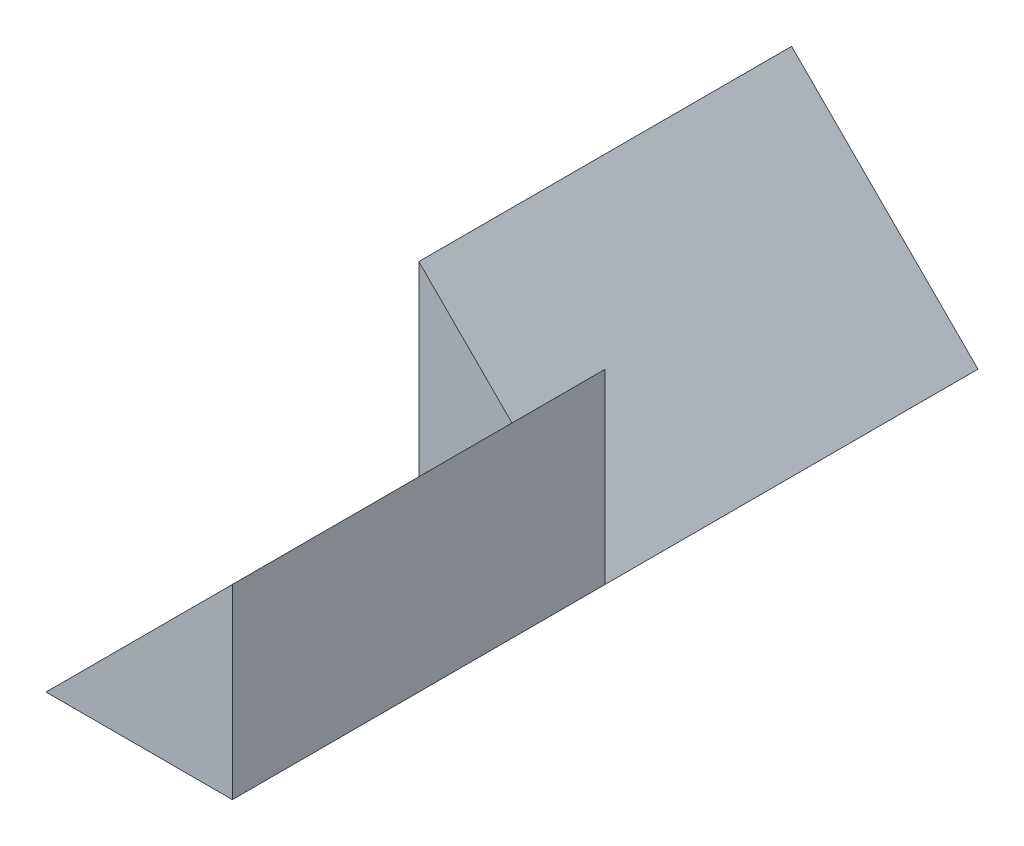
ISO-10303-21;
HEADER;
FILE_DESCRIPTION(('STEP AP214'),'2;1');
FILE_NAME('part.step','',(''),(''),'','','');
FILE_SCHEMA(('AUTOMOTIVE_DESIGN { 1 0 10303 214 1 1 1 1 }'));
ENDSEC;
DATA;
#1=APPLICATION_CONTEXT('core data for automotive mechanical design processes');
#2=APPLICATION_PROTOCOL_DEFINITION('international standard','automotive_design',2000,#1);
#3=PRODUCT_CONTEXT('',#1,'mechanical');
#4=PRODUCT('Part','Part','',(#3));
#5=PRODUCT_RELATED_PRODUCT_CATEGORY('part','',(#4));
#6=PRODUCT_DEFINITION_FORMATION('','',#4);
#7=PRODUCT_DEFINITION_CONTEXT('part definition',#1,'design');
#8=PRODUCT_DEFINITION('design','',#6,#7);
#9=PRODUCT_DEFINITION_SHAPE('','',#8);
#10=(LENGTH_UNIT() NAMED_UNIT(*) SI_UNIT(.MILLI.,.METRE.));
#11=(NAMED_UNIT(*) PLANE_ANGLE_UNIT() SI_UNIT($,.RADIAN.));
#12=(NAMED_UNIT(*) SI_UNIT($,.STERADIAN.) SOLID_ANGLE_UNIT());
#13=UNCERTAINTY_MEASURE_WITH_UNIT(LENGTH_MEASURE(1.E-05),#10,'distance_accuracy_value','');
#14=(GEOMETRIC_REPRESENTATION_CONTEXT(3) GLOBAL_UNCERTAINTY_ASSIGNED_CONTEXT((#13)) GLOBAL_UNIT_ASSIGNED_CONTEXT((#10,
#11,#12)) REPRESENTATION_CONTEXT('',''));
#15=CARTESIAN_POINT('',(0.,0.,0.));
#16=DIRECTION('',(0.,0.,1.));
#17=DIRECTION('',(1.,0.,0.));
#18=AXIS2_PLACEMENT_3D('',#15,#16,#17);
#19=CARTESIAN_POINT('',(0.,0.,2.));
#20=DIRECTION('',(0.,0.,-1.));
#21=DIRECTION('',(-1.,0.,0.));
#22=AXIS2_PLACEMENT_3D('',#19,#20,#21);
#23=PLANE('',#22);
#24=DIRECTION('',(-0.707106781186544,-0.707106781186551,0.));
#25=VECTOR('',#24,1.);
#26=CARTESIAN_POINT('',(1.,1.00000000000001,2.));
#27=LINE('',#26,#25);
#28=CARTESIAN_POINT('',(0.499999999999999,0.500000000000004,2.));
#29=VERTEX_POINT('',#28);
#30=CARTESIAN_POINT('',(0.,0.,2.));
#31=VERTEX_POINT('',#30);
#32=EDGE_CURVE('E11',#29,#31,#27,.T.);
#33=ORIENTED_EDGE('',*,*,#32,.F.);
#34=DIRECTION('',(-0.707106781186542,0.707106781186553,0.));
#35=VECTOR('',#34,1.);
#36=CARTESIAN_POINT('',(0.,1.00000000000001,2.));
#37=LINE('',#36,#35);
#38=CARTESIAN_POINT('',(0.,1.00000000000001,2.));
#39=VERTEX_POINT('',#38);
#40=EDGE_CURVE('E52',#29,#39,#37,.T.);
#41=ORIENTED_EDGE('',*,*,#40,.T.);
#42=DIRECTION('',(0.,-1.,0.));
#43=VECTOR('',#42,1.);
#44=CARTESIAN_POINT('',(0.,0.,2.));
#45=LINE('',#44,#43);
#46=EDGE_CURVE('E89',#39,#31,#45,.T.);
#47=ORIENTED_EDGE('',*,*,#46,.T.);
#48=EDGE_LOOP('',(#33,#41,#47));
#49=FACE_BOUND('',#48,.T.);
#50=ADVANCED_FACE('F33',(#49),#23,.F.);
#51=CARTESIAN_POINT('',(1.,0.,2.));
#52=DIRECTION('',(0.,1.,0.));
#53=DIRECTION('',(-1.,0.,0.));
#54=AXIS2_PLACEMENT_3D('',#51,#52,#53);
#55=PLANE('',#54);
#56=DIRECTION('',(1.,0.,0.));
#57=VECTOR('',#56,1.);
#58=CARTESIAN_POINT('',(1.,0.,0.));
#59=LINE('',#58,#57);
#60=CARTESIAN_POINT('',(0.,0.,0.));
#61=VERTEX_POINT('',#60);
#62=CARTESIAN_POINT('',(1.,0.,0.));
#63=VERTEX_POINT('',#62);
#64=EDGE_CURVE('E85',#61,#63,#59,.T.);
#65=ORIENTED_EDGE('',*,*,#64,.T.);
#66=DIRECTION('',(0.,0.,-1.));
#67=VECTOR('',#66,1.);
#68=CARTESIAN_POINT('',(1.,0.,2.));
#69=LINE('',#68,#67);
#70=CARTESIAN_POINT('',(1.,0.,2.));
#71=VERTEX_POINT('',#70);
#72=EDGE_CURVE('E37',#71,#63,#69,.T.);
#73=ORIENTED_EDGE('',*,*,#72,.F.);
#74=DIRECTION('',(0.,0.,-1.));
#75=VECTOR('',#74,1.);
#76=CARTESIAN_POINT('',(1.,0.,4.));
#77=LINE('',#76,#75);
#78=CARTESIAN_POINT('',(1.,0.,4.));
#79=VERTEX_POINT('',#78);
#80=EDGE_CURVE('E93',#79,#71,#77,.T.);
#81=ORIENTED_EDGE('',*,*,#80,.F.);
#82=DIRECTION('',(1.,0.,0.));
#83=VECTOR('',#82,1.);
#84=CARTESIAN_POINT('',(0.,0.,4.));
#85=LINE('',#84,#83);
#86=CARTESIAN_POINT('',(0.,0.,4.));
#87=VERTEX_POINT('',#86);
#88=EDGE_CURVE('E130',#87,#79,#85,.T.);
#89=ORIENTED_EDGE('',*,*,#88,.F.);
#90=DIRECTION('',(0.,0.,-1.));
#91=VECTOR('',#90,1.);
#92=CARTESIAN_POINT('',(0.,0.,4.));
#93=LINE('',#92,#91);
#94=EDGE_CURVE('E88',#87,#31,#93,.T.);
#95=ORIENTED_EDGE('',*,*,#94,.T.);
#96=DIRECTION('',(0.,0.,-1.));
#97=VECTOR('',#96,1.);
#98=CARTESIAN_POINT('',(0.,0.,2.));
#99=LINE('',#98,#97);
#100=EDGE_CURVE('E75',#31,#61,#99,.T.);
#101=ORIENTED_EDGE('',*,*,#100,.T.);
#102=EDGE_LOOP('',(#65,#73,#81,#89,#95,#101));
#103=FACE_BOUND('',#102,.T.);
#104=ADVANCED_FACE('F35',(#103),#55,.F.);
#105=CARTESIAN_POINT('',(0.,1.00000000000001,2.));
#106=DIRECTION('',(-0.707106781186553,-0.707106781186542,0.));
#107=DIRECTION('',(0.707106781186542,-0.707106781186553,0.));
#108=AXIS2_PLACEMENT_3D('',#105,#106,#107);
#109=PLANE('',#108);
#110=DIRECTION('',(-0.707106781186542,0.707106781186553,0.));
#111=VECTOR('',#110,1.);
#112=CARTESIAN_POINT('',(0.,1.00000000000001,0.));
#113=LINE('',#112,#111);
#114=CARTESIAN_POINT('',(0.,1.00000000000001,0.));
#115=VERTEX_POINT('',#114);
#116=EDGE_CURVE('E79',#63,#115,#113,.T.);
#117=ORIENTED_EDGE('',*,*,#116,.T.);
#118=DIRECTION('',(0.,0.,-1.));
#119=VECTOR('',#118,1.);
#120=CARTESIAN_POINT('',(0.,1.00000000000001,2.));
#121=LINE('',#120,#119);
#122=EDGE_CURVE('E76',#39,#115,#121,.T.);
#123=ORIENTED_EDGE('',*,*,#122,.F.);
#124=ORIENTED_EDGE('',*,*,#40,.F.);
#125=EDGE_CURVE('E104',#71,#29,#37,.T.);
#126=ORIENTED_EDGE('',*,*,#125,.F.);
#127=ORIENTED_EDGE('',*,*,#72,.T.);
#128=EDGE_LOOP('',(#117,#123,#124,#126,#127));
#129=FACE_BOUND('',#128,.T.);
#130=ADVANCED_FACE('F102',(#129),#109,.F.);
#131=CARTESIAN_POINT('',(0.,0.,2.));
#132=DIRECTION('',(1.,0.,0.));
#133=DIRECTION('',(0.,0.,-1.));
#134=AXIS2_PLACEMENT_3D('',#131,#132,#133);
#135=PLANE('',#134);
#136=DIRECTION('',(0.,-1.,0.));
#137=VECTOR('',#136,1.);
#138=CARTESIAN_POINT('',(0.,0.,0.));
#139=LINE('',#138,#137);
#140=EDGE_CURVE('E70',#115,#61,#139,.T.);
#141=ORIENTED_EDGE('',*,*,#140,.T.);
#142=ORIENTED_EDGE('',*,*,#100,.F.);
#143=ORIENTED_EDGE('',*,*,#46,.F.);
#144=ORIENTED_EDGE('',*,*,#122,.T.);
#145=EDGE_LOOP('',(#141,#142,#143,#144));
#146=FACE_BOUND('',#145,.T.);
#147=ADVANCED_FACE('F72',(#146),#135,.F.);
#148=CARTESIAN_POINT('',(0.,0.,0.));
#149=DIRECTION('',(0.,0.,-1.));
#150=DIRECTION('',(-1.,0.,0.));
#151=AXIS2_PLACEMENT_3D('',#148,#149,#150);
#152=PLANE('',#151);
#153=ORIENTED_EDGE('',*,*,#64,.F.);
#154=ORIENTED_EDGE('',*,*,#140,.F.);
#155=ORIENTED_EDGE('',*,*,#116,.F.);
#156=EDGE_LOOP('',(#153,#154,#155));
#157=FACE_BOUND('',#156,.T.);
#158=ADVANCED_FACE('F91',(#157),#152,.T.);
#159=CARTESIAN_POINT('',(0.,0.,2.));
#160=DIRECTION('',(0.,0.,1.));
#161=DIRECTION('',(1.,0.,0.));
#162=AXIS2_PLACEMENT_3D('',#159,#160,#161);
#163=PLANE('',#162);
#164=DIRECTION('',(0.,1.,0.));
#165=VECTOR('',#164,1.);
#166=CARTESIAN_POINT('',(1.,0.,2.));
#167=LINE('',#166,#165);
#168=CARTESIAN_POINT('',(1.,1.00000000000001,2.));
#169=VERTEX_POINT('',#168);
#170=EDGE_CURVE('E111',#71,#169,#167,.T.);
#171=ORIENTED_EDGE('',*,*,#170,.F.);
#172=ORIENTED_EDGE('',*,*,#125,.T.);
#173=EDGE_CURVE('E43',#169,#29,#27,.T.);
#174=ORIENTED_EDGE('',*,*,#173,.F.);
#175=EDGE_LOOP('',(#171,#172,#174));
#176=FACE_BOUND('',#175,.T.);
#177=ADVANCED_FACE('F112',(#176),#163,.F.);
#178=CARTESIAN_POINT('',(1.,0.,4.));
#179=DIRECTION('',(-1.,0.,0.));
#180=DIRECTION('',(0.,0.,1.));
#181=AXIS2_PLACEMENT_3D('',#178,#179,#180);
#182=PLANE('',#181);
#183=ORIENTED_EDGE('',*,*,#170,.T.);
#184=DIRECTION('',(0.,0.,-1.));
#185=VECTOR('',#184,1.);
#186=CARTESIAN_POINT('',(1.,1.00000000000001,4.));
#187=LINE('',#186,#185);
#188=CARTESIAN_POINT('',(1.,1.00000000000001,4.));
#189=VERTEX_POINT('',#188);
#190=EDGE_CURVE('E97',#189,#169,#187,.T.);
#191=ORIENTED_EDGE('',*,*,#190,.F.);
#192=DIRECTION('',(0.,1.,0.));
#193=VECTOR('',#192,1.);
#194=CARTESIAN_POINT('',(1.,0.,4.));
#195=LINE('',#194,#193);
#196=EDGE_CURVE('E122',#79,#189,#195,.T.);
#197=ORIENTED_EDGE('',*,*,#196,.F.);
#198=ORIENTED_EDGE('',*,*,#80,.T.);
#199=EDGE_LOOP('',(#183,#191,#197,#198));
#200=FACE_BOUND('',#199,.T.);
#201=ADVANCED_FACE('F120',(#200),#182,.F.);
#202=CARTESIAN_POINT('',(1.,1.00000000000001,4.));
#203=DIRECTION('',(0.707106781186551,-0.707106781186544,0.));
#204=DIRECTION('',(0.707106781186544,0.707106781186551,0.));
#205=AXIS2_PLACEMENT_3D('',#202,#203,#204);
#206=PLANE('',#205);
#207=ORIENTED_EDGE('',*,*,#173,.T.);
#208=ORIENTED_EDGE('',*,*,#32,.T.);
#209=ORIENTED_EDGE('',*,*,#94,.F.);
#210=DIRECTION('',(-0.707106781186544,-0.707106781186551,0.));
#211=VECTOR('',#210,1.);
#212=CARTESIAN_POINT('',(1.,1.00000000000001,4.));
#213=LINE('',#212,#211);
#214=EDGE_CURVE('E129',#189,#87,#213,.T.);
#215=ORIENTED_EDGE('',*,*,#214,.F.);
#216=ORIENTED_EDGE('',*,*,#190,.T.);
#217=EDGE_LOOP('',(#207,#208,#209,#215,#216));
#218=FACE_BOUND('',#217,.T.);
#219=ADVANCED_FACE('F138',(#218),#206,.F.);
#220=CARTESIAN_POINT('',(0.,0.,4.));
#221=DIRECTION('',(0.,0.,1.));
#222=DIRECTION('',(1.,0.,0.));
#223=AXIS2_PLACEMENT_3D('',#220,#221,#222);
#224=PLANE('',#223);
#225=ORIENTED_EDGE('',*,*,#88,.T.);
#226=ORIENTED_EDGE('',*,*,#196,.T.);
#227=ORIENTED_EDGE('',*,*,#214,.T.);
#228=EDGE_LOOP('',(#225,#226,#227));
#229=FACE_BOUND('',#228,.T.);
#230=ADVANCED_FACE('F132',(#229),#224,.T.);
#231=CLOSED_SHELL('',(#50,#104,#130,#147,#158,#177,#201,#219,#230));
#232=MANIFOLD_SOLID_BREP('B2',#231);
#233=ADVANCED_BREP_SHAPE_REPRESENTATION('',(#18,#232),#14);
#234=SHAPE_DEFINITION_REPRESENTATION(#9,#233);
ENDSEC;
END-ISO-10303-21;
